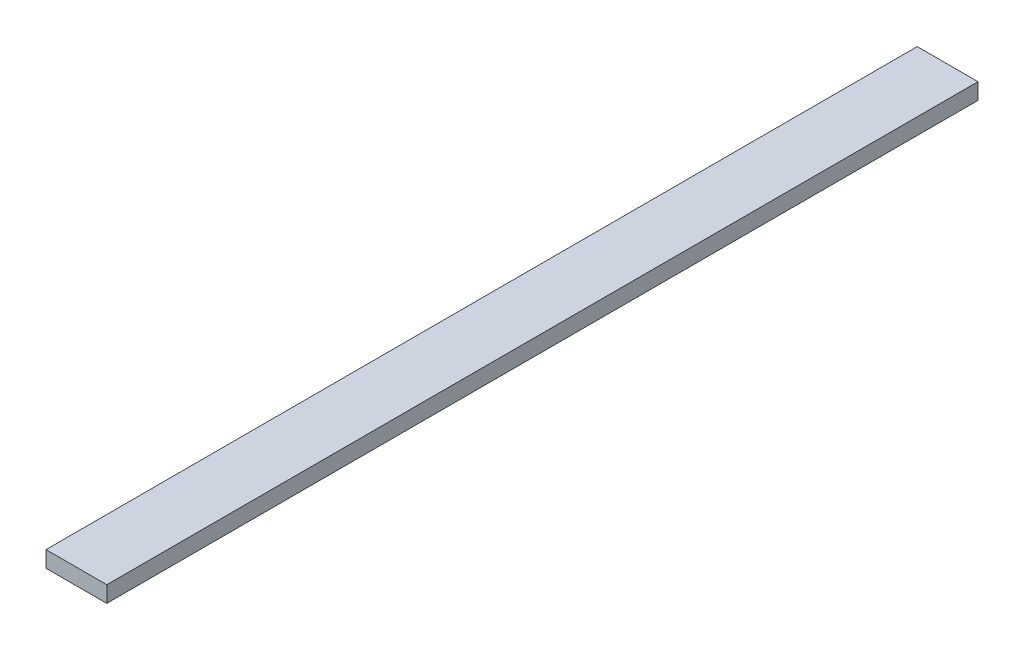
ISO-10303-21;
HEADER;
FILE_DESCRIPTION(('STEP AP214'),'2;1');
FILE_NAME('part.step','',(''),(''),'','','');
FILE_SCHEMA(('AUTOMOTIVE_DESIGN { 1 0 10303 214 1 1 1 1 }'));
ENDSEC;
DATA;
#1=APPLICATION_CONTEXT('core data for automotive mechanical design processes');
#2=APPLICATION_PROTOCOL_DEFINITION('international standard','automotive_design',2000,#1);
#3=PRODUCT_CONTEXT('',#1,'mechanical');
#4=PRODUCT('Part','Part','',(#3));
#5=PRODUCT_RELATED_PRODUCT_CATEGORY('part','',(#4));
#6=PRODUCT_DEFINITION_FORMATION('','',#4);
#7=PRODUCT_DEFINITION_CONTEXT('part definition',#1,'design');
#8=PRODUCT_DEFINITION('design','',#6,#7);
#9=PRODUCT_DEFINITION_SHAPE('','',#8);
#10=(LENGTH_UNIT() NAMED_UNIT(*) SI_UNIT(.MILLI.,.METRE.));
#11=(NAMED_UNIT(*) PLANE_ANGLE_UNIT() SI_UNIT($,.RADIAN.));
#12=(NAMED_UNIT(*) SI_UNIT($,.STERADIAN.) SOLID_ANGLE_UNIT());
#13=UNCERTAINTY_MEASURE_WITH_UNIT(LENGTH_MEASURE(1.E-05),#10,'distance_accuracy_value','');
#14=(GEOMETRIC_REPRESENTATION_CONTEXT(3) GLOBAL_UNCERTAINTY_ASSIGNED_CONTEXT((#13)) GLOBAL_UNIT_ASSIGNED_CONTEXT((#10,
#11,#12)) REPRESENTATION_CONTEXT('',''));
#15=CARTESIAN_POINT('',(0.,0.,0.));
#16=DIRECTION('',(0.,0.,1.));
#17=DIRECTION('',(1.,0.,0.));
#18=AXIS2_PLACEMENT_3D('',#15,#16,#17);
#19=CARTESIAN_POINT('',(15.,4.,430.));
#20=DIRECTION('',(-1.,0.,0.));
#21=DIRECTION('',(0.,0.,1.));
#22=AXIS2_PLACEMENT_3D('',#19,#20,#21);
#23=PLANE('',#22);
#24=DIRECTION('',(0.,1.,0.));
#25=VECTOR('',#24,1.);
#26=CARTESIAN_POINT('',(15.,4.,0.));
#27=LINE('',#26,#25);
#28=CARTESIAN_POINT('',(15.,-4.,0.));
#29=VERTEX_POINT('',#28);
#30=CARTESIAN_POINT('',(15.,4.,0.));
#31=VERTEX_POINT('',#30);
#32=EDGE_CURVE('E98',#29,#31,#27,.T.);
#33=ORIENTED_EDGE('',*,*,#32,.T.);
#34=DIRECTION('',(0.,0.,-1.));
#35=VECTOR('',#34,1.);
#36=CARTESIAN_POINT('',(15.,4.,430.));
#37=LINE('',#36,#35);
#38=CARTESIAN_POINT('',(15.,4.,430.));
#39=VERTEX_POINT('',#38);
#40=EDGE_CURVE('E11',#39,#31,#37,.T.);
#41=ORIENTED_EDGE('',*,*,#40,.F.);
#42=DIRECTION('',(0.,1.,0.));
#43=VECTOR('',#42,1.);
#44=CARTESIAN_POINT('',(15.,4.,430.));
#45=LINE('',#44,#43);
#46=CARTESIAN_POINT('',(15.,-4.,430.));
#47=VERTEX_POINT('',#46);
#48=EDGE_CURVE('E86',#47,#39,#45,.T.);
#49=ORIENTED_EDGE('',*,*,#48,.F.);
#50=DIRECTION('',(0.,0.,-1.));
#51=VECTOR('',#50,1.);
#52=CARTESIAN_POINT('',(15.,-4.,430.));
#53=LINE('',#52,#51);
#54=EDGE_CURVE('E94',#47,#29,#53,.T.);
#55=ORIENTED_EDGE('',*,*,#54,.T.);
#56=EDGE_LOOP('',(#33,#41,#49,#55));
#57=FACE_BOUND('',#56,.T.);
#58=ADVANCED_FACE('F35',(#57),#23,.F.);
#59=CARTESIAN_POINT('',(-15.,4.,430.));
#60=DIRECTION('',(0.,-1.,0.));
#61=DIRECTION('',(0.,0.,-1.));
#62=AXIS2_PLACEMENT_3D('',#59,#60,#61);
#63=PLANE('',#62);
#64=DIRECTION('',(-1.,0.,0.));
#65=VECTOR('',#64,1.);
#66=CARTESIAN_POINT('',(-15.,4.,0.));
#67=LINE('',#66,#65);
#68=CARTESIAN_POINT('',(-15.,4.,0.));
#69=VERTEX_POINT('',#68);
#70=EDGE_CURVE('E90',#31,#69,#67,.T.);
#71=ORIENTED_EDGE('',*,*,#70,.T.);
#72=DIRECTION('',(0.,0.,-1.));
#73=VECTOR('',#72,1.);
#74=CARTESIAN_POINT('',(-15.,4.,430.));
#75=LINE('',#74,#73);
#76=CARTESIAN_POINT('',(-15.,4.,430.));
#77=VERTEX_POINT('',#76);
#78=EDGE_CURVE('E43',#77,#69,#75,.T.);
#79=ORIENTED_EDGE('',*,*,#78,.F.);
#80=DIRECTION('',(-1.,0.,0.));
#81=VECTOR('',#80,1.);
#82=CARTESIAN_POINT('',(-15.,4.,430.));
#83=LINE('',#82,#81);
#84=EDGE_CURVE('E81',#39,#77,#83,.T.);
#85=ORIENTED_EDGE('',*,*,#84,.F.);
#86=ORIENTED_EDGE('',*,*,#40,.T.);
#87=EDGE_LOOP('',(#71,#79,#85,#86));
#88=FACE_BOUND('',#87,.T.);
#89=ADVANCED_FACE('F89',(#88),#63,.F.);
#90=CARTESIAN_POINT('',(-15.,4.,430.));
#91=DIRECTION('',(1.,0.,0.));
#92=DIRECTION('',(0.,0.,-1.));
#93=AXIS2_PLACEMENT_3D('',#90,#91,#92);
#94=PLANE('',#93);
#95=DIRECTION('',(0.,-1.,0.));
#96=VECTOR('',#95,1.);
#97=CARTESIAN_POINT('',(-15.,4.,0.));
#98=LINE('',#97,#96);
#99=CARTESIAN_POINT('',(-15.,-4.,0.));
#100=VERTEX_POINT('',#99);
#101=EDGE_CURVE('E68',#69,#100,#98,.T.);
#102=ORIENTED_EDGE('',*,*,#101,.T.);
#103=DIRECTION('',(0.,0.,-1.));
#104=VECTOR('',#103,1.);
#105=CARTESIAN_POINT('',(-15.,-4.,430.));
#106=LINE('',#105,#104);
#107=CARTESIAN_POINT('',(-15.,-4.,430.));
#108=VERTEX_POINT('',#107);
#109=EDGE_CURVE('E91',#108,#100,#106,.T.);
#110=ORIENTED_EDGE('',*,*,#109,.F.);
#111=DIRECTION('',(0.,-1.,0.));
#112=VECTOR('',#111,1.);
#113=CARTESIAN_POINT('',(-15.,4.,430.));
#114=LINE('',#113,#112);
#115=EDGE_CURVE('E84',#77,#108,#114,.T.);
#116=ORIENTED_EDGE('',*,*,#115,.F.);
#117=ORIENTED_EDGE('',*,*,#78,.T.);
#118=EDGE_LOOP('',(#102,#110,#116,#117));
#119=FACE_BOUND('',#118,.T.);
#120=ADVANCED_FACE('F92',(#119),#94,.F.);
#121=CARTESIAN_POINT('',(-15.,-4.,430.));
#122=DIRECTION('',(0.,1.,0.));
#123=DIRECTION('',(0.,0.,1.));
#124=AXIS2_PLACEMENT_3D('',#121,#122,#123);
#125=PLANE('',#124);
#126=DIRECTION('',(1.,0.,0.));
#127=VECTOR('',#126,1.);
#128=CARTESIAN_POINT('',(-15.,-4.,0.));
#129=LINE('',#128,#127);
#130=EDGE_CURVE('E74',#100,#29,#129,.T.);
#131=ORIENTED_EDGE('',*,*,#130,.T.);
#132=ORIENTED_EDGE('',*,*,#54,.F.);
#133=DIRECTION('',(1.,0.,0.));
#134=VECTOR('',#133,1.);
#135=CARTESIAN_POINT('',(-15.,-4.,430.));
#136=LINE('',#135,#134);
#137=EDGE_CURVE('E51',#108,#47,#136,.T.);
#138=ORIENTED_EDGE('',*,*,#137,.F.);
#139=ORIENTED_EDGE('',*,*,#109,.T.);
#140=EDGE_LOOP('',(#131,#132,#138,#139));
#141=FACE_BOUND('',#140,.T.);
#142=ADVANCED_FACE('F105',(#141),#125,.F.);
#143=CARTESIAN_POINT('',(0.,0.,430.));
#144=DIRECTION('',(0.,0.,1.));
#145=DIRECTION('',(1.,0.,0.));
#146=AXIS2_PLACEMENT_3D('',#143,#144,#145);
#147=PLANE('',#146);
#148=ORIENTED_EDGE('',*,*,#48,.T.);
#149=ORIENTED_EDGE('',*,*,#84,.T.);
#150=ORIENTED_EDGE('',*,*,#115,.T.);
#151=ORIENTED_EDGE('',*,*,#137,.T.);
#152=EDGE_LOOP('',(#148,#149,#150,#151));
#153=FACE_BOUND('',#152,.T.);
#154=ADVANCED_FACE('F82',(#153),#147,.T.);
#155=CARTESIAN_POINT('',(0.,0.,0.));
#156=DIRECTION('',(0.,0.,1.));
#157=DIRECTION('',(1.,0.,0.));
#158=AXIS2_PLACEMENT_3D('',#155,#156,#157);
#159=PLANE('',#158);
#160=ORIENTED_EDGE('',*,*,#32,.F.);
#161=ORIENTED_EDGE('',*,*,#130,.F.);
#162=ORIENTED_EDGE('',*,*,#101,.F.);
#163=ORIENTED_EDGE('',*,*,#70,.F.);
#164=EDGE_LOOP('',(#160,#161,#162,#163));
#165=FACE_BOUND('',#164,.T.);
#166=ADVANCED_FACE('F108',(#165),#159,.F.);
#167=CLOSED_SHELL('',(#58,#89,#120,#142,#154,#166));
#168=MANIFOLD_SOLID_BREP('B2',#167);
#169=ADVANCED_BREP_SHAPE_REPRESENTATION('',(#18,#168),#14);
#170=SHAPE_DEFINITION_REPRESENTATION(#9,#169);
ENDSEC;
END-ISO-10303-21;
